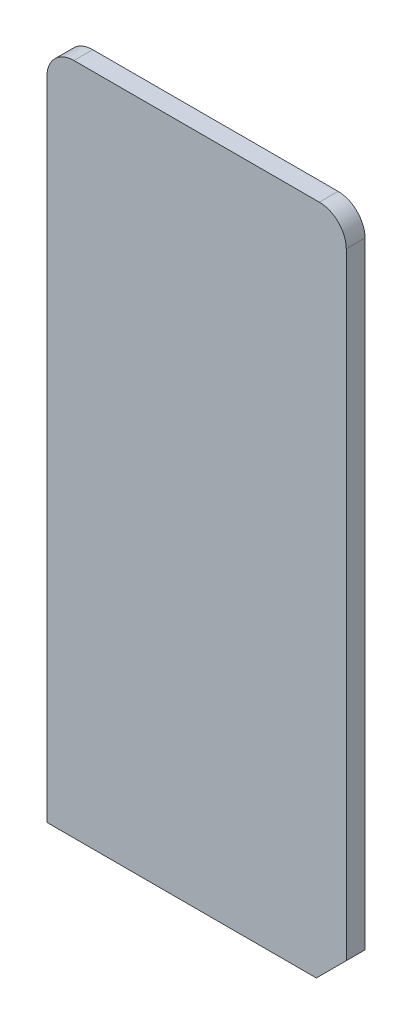
ISO-10303-21;
HEADER;
FILE_DESCRIPTION(('STEP AP214'),'2;1');
FILE_NAME('part.step','',(''),(''),'','','');
FILE_SCHEMA(('AUTOMOTIVE_DESIGN { 1 0 10303 214 1 1 1 1 }'));
ENDSEC;
DATA;
#1=APPLICATION_CONTEXT('core data for automotive mechanical design processes');
#2=APPLICATION_PROTOCOL_DEFINITION('international standard','automotive_design',2000,#1);
#3=PRODUCT_CONTEXT('',#1,'mechanical');
#4=PRODUCT('Part','Part','',(#3));
#5=PRODUCT_RELATED_PRODUCT_CATEGORY('part','',(#4));
#6=PRODUCT_DEFINITION_FORMATION('','',#4);
#7=PRODUCT_DEFINITION_CONTEXT('part definition',#1,'design');
#8=PRODUCT_DEFINITION('design','',#6,#7);
#9=PRODUCT_DEFINITION_SHAPE('','',#8);
#10=(LENGTH_UNIT() NAMED_UNIT(*) SI_UNIT(.MILLI.,.METRE.));
#11=(NAMED_UNIT(*) PLANE_ANGLE_UNIT() SI_UNIT($,.RADIAN.));
#12=(NAMED_UNIT(*) SI_UNIT($,.STERADIAN.) SOLID_ANGLE_UNIT());
#13=UNCERTAINTY_MEASURE_WITH_UNIT(LENGTH_MEASURE(1.E-05),#10,'distance_accuracy_value','');
#14=(GEOMETRIC_REPRESENTATION_CONTEXT(3) GLOBAL_UNCERTAINTY_ASSIGNED_CONTEXT((#13)) GLOBAL_UNIT_ASSIGNED_CONTEXT((#10,
#11,#12)) REPRESENTATION_CONTEXT('',''));
#15=CARTESIAN_POINT('',(0.,0.,0.));
#16=DIRECTION('',(0.,0.,1.));
#17=DIRECTION('',(1.,0.,0.));
#18=AXIS2_PLACEMENT_3D('',#15,#16,#17);
#19=CARTESIAN_POINT('',(-1.269999980927,-3.80999994278,-1.591437));
#20=DIRECTION('',(0.,0.,1.));
#21=DIRECTION('',(1.,0.,0.));
#22=AXIS2_PLACEMENT_3D('',#19,#20,#21);
#23=PLANE('',#22);
#24=CARTESIAN_POINT('',(1.017527650657,51.052472520526,-1.591437));
#25=DIRECTION('',(0.,0.,-1.));
#26=DIRECTION('',(-1.,0.,0.));
#27=AXIS2_PLACEMENT_3D('',#24,#25,#26);
#28=CIRCLE('',#27,2.287528142136);
#29=CARTESIAN_POINT('',(1.016000032425,53.340000152588,-1.591437));
#30=VERTEX_POINT('',#29);
#31=CARTESIAN_POINT('',(-1.26999998092691,51.054000854492,-1.591437));
#32=VERTEX_POINT('',#31);
#33=EDGE_CURVE('E96',#30,#32,#28,.F.);
#34=ORIENTED_EDGE('',*,*,#33,.F.);
#35=DIRECTION('',(1.,0.,0.));
#36=VECTOR('',#35,1.);
#37=CARTESIAN_POINT('',(1.016000032425,53.340000152588,-1.591437));
#38=LINE('',#37,#36);
#39=CARTESIAN_POINT('',(21.843999862671,53.3400001525877,-1.591437));
#40=VERTEX_POINT('',#39);
#41=EDGE_CURVE('E111',#40,#30,#38,.F.);
#42=ORIENTED_EDGE('',*,*,#41,.F.);
#43=CARTESIAN_POINT('',(21.842471324535,51.052472316356,-1.591437));
#44=DIRECTION('',(0.,0.,-1.));
#45=DIRECTION('',(-1.,0.,0.));
#46=AXIS2_PLACEMENT_3D('',#43,#44,#45);
#47=CIRCLE('',#46,2.28752834692);
#48=CARTESIAN_POINT('',(24.1299991607667,51.054000854492,-1.591437));
#49=VERTEX_POINT('',#48);
#50=EDGE_CURVE('E20',#49,#40,#47,.F.);
#51=ORIENTED_EDGE('',*,*,#50,.F.);
#52=DIRECTION('',(0.,1.,0.));
#53=VECTOR('',#52,1.);
#54=CARTESIAN_POINT('',(24.129999160767,51.054000854492,-1.591437));
#55=LINE('',#54,#53);
#56=CARTESIAN_POINT('',(24.129999160767,-1.269999980927,-1.591437));
#57=VERTEX_POINT('',#56);
#58=EDGE_CURVE('E60',#57,#49,#55,.T.);
#59=ORIENTED_EDGE('',*,*,#58,.F.);
#60=DIRECTION('',(0.707106648440535,0.707106913932535,0.));
#61=VECTOR('',#60,1.);
#62=CARTESIAN_POINT('',(24.129999160767,-1.269999980927,-1.591437));
#63=LINE('',#62,#61);
#64=CARTESIAN_POINT('',(21.5900001525881,-3.80999994278009,-1.591437));
#65=VERTEX_POINT('',#64);
#66=EDGE_CURVE('E70',#65,#57,#63,.T.);
#67=ORIENTED_EDGE('',*,*,#66,.F.);
#68=DIRECTION('',(1.,0.,0.));
#69=VECTOR('',#68,1.);
#70=CARTESIAN_POINT('',(21.590000152588,-3.80999994278,-1.591437));
#71=LINE('',#70,#69);
#72=CARTESIAN_POINT('',(-1.269999980927,-3.80999994278,-1.591437));
#73=VERTEX_POINT('',#72);
#74=EDGE_CURVE('E81',#73,#65,#71,.T.);
#75=ORIENTED_EDGE('',*,*,#74,.F.);
#76=DIRECTION('',(0.,1.,0.));
#77=VECTOR('',#76,1.);
#78=CARTESIAN_POINT('',(-1.269999980927,-3.80999994278,-1.591437));
#79=LINE('',#78,#77);
#80=EDGE_CURVE('E85',#32,#73,#79,.F.);
#81=ORIENTED_EDGE('',*,*,#80,.F.);
#82=EDGE_LOOP('',(#34,#42,#51,#59,#67,#75,#81));
#83=FACE_BOUND('',#82,.T.);
#84=ADVANCED_FACE('F17',(#83),#23,.F.);
#85=CARTESIAN_POINT('',(21.590000152588,-3.80999994278,-1.591437));
#86=DIRECTION('',(0.,-1.,0.));
#87=DIRECTION('',(0.,0.,-1.));
#88=AXIS2_PLACEMENT_3D('',#85,#86,#87);
#89=PLANE('',#88);
#90=DIRECTION('',(0.,0.,1.));
#91=VECTOR('',#90,1.);
#92=CARTESIAN_POINT('',(-1.269999980927,-3.80999994278,-1.591437));
#93=LINE('',#92,#91);
#94=CARTESIAN_POINT('',(-1.269999980927,-3.80999994278,0.));
#95=VERTEX_POINT('',#94);
#96=EDGE_CURVE('E91',#73,#95,#93,.T.);
#97=ORIENTED_EDGE('',*,*,#96,.F.);
#98=ORIENTED_EDGE('',*,*,#74,.T.);
#99=DIRECTION('',(0.,0.,1.));
#100=VECTOR('',#99,1.);
#101=CARTESIAN_POINT('',(21.5900001525881,-3.80999994278013,-1.591437));
#102=LINE('',#101,#100);
#103=CARTESIAN_POINT('',(21.590000152588,-3.80999994278005,0.));
#104=VERTEX_POINT('',#103);
#105=EDGE_CURVE('E87',#104,#65,#102,.F.);
#106=ORIENTED_EDGE('',*,*,#105,.F.);
#107=DIRECTION('',(1.,0.,0.));
#108=VECTOR('',#107,1.);
#109=CARTESIAN_POINT('',(-1.269999980927,-3.80999994278,0.));
#110=LINE('',#109,#108);
#111=EDGE_CURVE('E94',#95,#104,#110,.T.);
#112=ORIENTED_EDGE('',*,*,#111,.F.);
#113=EDGE_LOOP('',(#97,#98,#106,#112));
#114=FACE_BOUND('',#113,.T.);
#115=ADVANCED_FACE('F92',(#114),#89,.T.);
#116=CARTESIAN_POINT('',(24.129999160767,-1.269999980927,-1.591437));
#117=DIRECTION('',(0.707106913932535,-0.707106648440535,0.));
#118=DIRECTION('',(0.707106648440535,0.707106913932535,0.));
#119=AXIS2_PLACEMENT_3D('',#116,#117,#118);
#120=PLANE('',#119);
#121=ORIENTED_EDGE('',*,*,#105,.T.);
#122=ORIENTED_EDGE('',*,*,#66,.T.);
#123=DIRECTION('',(0.,0.,-1.));
#124=VECTOR('',#123,1.);
#125=CARTESIAN_POINT('',(24.129999160767,-1.269999980927,-1.591437));
#126=LINE('',#125,#124);
#127=CARTESIAN_POINT('',(24.129999160767,-1.269999980927,0.));
#128=VERTEX_POINT('',#127);
#129=EDGE_CURVE('E117',#128,#57,#126,.T.);
#130=ORIENTED_EDGE('',*,*,#129,.F.);
#131=DIRECTION('',(0.707106648440572,0.707106913932498,0.));
#132=VECTOR('',#131,1.);
#133=CARTESIAN_POINT('',(21.590000152588,-3.80999994278,0.));
#134=LINE('',#133,#132);
#135=EDGE_CURVE('E100',#104,#128,#134,.T.);
#136=ORIENTED_EDGE('',*,*,#135,.F.);
#137=EDGE_LOOP('',(#121,#122,#130,#136));
#138=FACE_BOUND('',#137,.T.);
#139=ADVANCED_FACE('F145',(#138),#120,.T.);
#140=CARTESIAN_POINT('',(24.129999160767,51.054000854492,-1.591437));
#141=DIRECTION('',(1.,0.,0.));
#142=DIRECTION('',(0.,0.,-1.));
#143=AXIS2_PLACEMENT_3D('',#140,#141,#142);
#144=PLANE('',#143);
#145=ORIENTED_EDGE('',*,*,#129,.T.);
#146=ORIENTED_EDGE('',*,*,#58,.T.);
#147=DIRECTION('',(0.,0.,-1.));
#148=VECTOR('',#147,1.);
#149=CARTESIAN_POINT('',(24.1299991607664,51.054000854492,-1.591437));
#150=LINE('',#149,#148);
#151=CARTESIAN_POINT('',(24.1299991607666,51.054000854492,0.));
#152=VERTEX_POINT('',#151);
#153=EDGE_CURVE('E116',#152,#49,#150,.T.);
#154=ORIENTED_EDGE('',*,*,#153,.F.);
#155=DIRECTION('',(0.,1.,0.));
#156=VECTOR('',#155,1.);
#157=CARTESIAN_POINT('',(24.129999160767,-3.80999994278,0.));
#158=LINE('',#157,#156);
#159=EDGE_CURVE('E128',#128,#152,#158,.T.);
#160=ORIENTED_EDGE('',*,*,#159,.F.);
#161=EDGE_LOOP('',(#145,#146,#154,#160));
#162=FACE_BOUND('',#161,.T.);
#163=ADVANCED_FACE('F197',(#162),#144,.T.);
#164=CARTESIAN_POINT('',(21.842471324535,51.052472316356,-1.591437));
#165=DIRECTION('',(0.,0.,-1.));
#166=DIRECTION('',(-1.,0.,0.));
#167=AXIS2_PLACEMENT_3D('',#164,#165,#166);
#168=CYLINDRICAL_SURFACE('',#167,2.28752834692);
#169=ORIENTED_EDGE('',*,*,#153,.T.);
#170=ORIENTED_EDGE('',*,*,#50,.T.);
#171=DIRECTION('',(0.,0.,1.));
#172=VECTOR('',#171,1.);
#173=CARTESIAN_POINT('',(21.843999862671,53.340000152588,-1.591437));
#174=LINE('',#173,#172);
#175=CARTESIAN_POINT('',(21.843999862671,53.340000152588,0.));
#176=VERTEX_POINT('',#175);
#177=EDGE_CURVE('E114',#176,#40,#174,.F.);
#178=ORIENTED_EDGE('',*,*,#177,.F.);
#179=CARTESIAN_POINT('',(21.842471324535,51.052472316356,0.));
#180=DIRECTION('',(0.,0.,-1.));
#181=DIRECTION('',(-1.,0.,0.));
#182=AXIS2_PLACEMENT_3D('',#179,#180,#181);
#183=CIRCLE('',#182,2.28752834692);
#184=EDGE_CURVE('E126',#152,#176,#183,.F.);
#185=ORIENTED_EDGE('',*,*,#184,.F.);
#186=EDGE_LOOP('',(#169,#170,#178,#185));
#187=FACE_BOUND('',#186,.T.);
#188=ADVANCED_FACE('F162',(#187),#168,.T.);
#189=CARTESIAN_POINT('',(1.016000032425,53.340000152588,-1.591437));
#190=DIRECTION('',(0.,1.,0.));
#191=DIRECTION('',(0.,0.,1.));
#192=AXIS2_PLACEMENT_3D('',#189,#190,#191);
#193=PLANE('',#192);
#194=ORIENTED_EDGE('',*,*,#177,.T.);
#195=ORIENTED_EDGE('',*,*,#41,.T.);
#196=DIRECTION('',(0.,0.,-1.));
#197=VECTOR('',#196,1.);
#198=CARTESIAN_POINT('',(1.016000032425,53.3400001525879,-1.591437));
#199=LINE('',#198,#197);
#200=CARTESIAN_POINT('',(1.016000032425,53.3400001525879,0.));
#201=VERTEX_POINT('',#200);
#202=EDGE_CURVE('E113',#201,#30,#199,.T.);
#203=ORIENTED_EDGE('',*,*,#202,.F.);
#204=DIRECTION('',(1.,0.,0.));
#205=VECTOR('',#204,1.);
#206=CARTESIAN_POINT('',(-1.269999980927,53.340000152588,0.));
#207=LINE('',#206,#205);
#208=EDGE_CURVE('E125',#176,#201,#207,.F.);
#209=ORIENTED_EDGE('',*,*,#208,.F.);
#210=EDGE_LOOP('',(#194,#195,#203,#209));
#211=FACE_BOUND('',#210,.T.);
#212=ADVANCED_FACE('F154',(#211),#193,.T.);
#213=CARTESIAN_POINT('',(1.017527650657,51.052472520526,-1.591437));
#214=DIRECTION('',(0.,0.,-1.));
#215=DIRECTION('',(-1.,0.,0.));
#216=AXIS2_PLACEMENT_3D('',#213,#214,#215);
#217=CYLINDRICAL_SURFACE('',#216,2.287528142136);
#218=ORIENTED_EDGE('',*,*,#202,.T.);
#219=ORIENTED_EDGE('',*,*,#33,.T.);
#220=DIRECTION('',(0.,0.,1.));
#221=VECTOR('',#220,1.);
#222=CARTESIAN_POINT('',(-1.269999980927,51.054000854492,-1.591437));
#223=LINE('',#222,#221);
#224=CARTESIAN_POINT('',(-1.269999980927,51.054000854492,0.));
#225=VERTEX_POINT('',#224);
#226=EDGE_CURVE('E35',#225,#32,#223,.F.);
#227=ORIENTED_EDGE('',*,*,#226,.F.);
#228=CARTESIAN_POINT('',(1.017527650657,51.052472520526,0.));
#229=DIRECTION('',(0.,0.,-1.));
#230=DIRECTION('',(-1.,0.,0.));
#231=AXIS2_PLACEMENT_3D('',#228,#229,#230);
#232=CIRCLE('',#231,2.287528142136);
#233=EDGE_CURVE('E26',#201,#225,#232,.F.);
#234=ORIENTED_EDGE('',*,*,#233,.F.);
#235=EDGE_LOOP('',(#218,#219,#227,#234));
#236=FACE_BOUND('',#235,.T.);
#237=ADVANCED_FACE('F152',(#236),#217,.T.);
#238=CARTESIAN_POINT('',(-1.269999980927,-3.80999994278,-1.591437));
#239=DIRECTION('',(-1.,0.,0.));
#240=DIRECTION('',(0.,0.,1.));
#241=AXIS2_PLACEMENT_3D('',#238,#239,#240);
#242=PLANE('',#241);
#243=ORIENTED_EDGE('',*,*,#226,.T.);
#244=ORIENTED_EDGE('',*,*,#80,.T.);
#245=ORIENTED_EDGE('',*,*,#96,.T.);
#246=DIRECTION('',(0.,1.,0.));
#247=VECTOR('',#246,1.);
#248=CARTESIAN_POINT('',(-1.269999980927,-3.80999994278,0.));
#249=LINE('',#248,#247);
#250=EDGE_CURVE('E11',#225,#95,#249,.F.);
#251=ORIENTED_EDGE('',*,*,#250,.F.);
#252=EDGE_LOOP('',(#243,#244,#245,#251));
#253=FACE_BOUND('',#252,.T.);
#254=ADVANCED_FACE('F98',(#253),#242,.T.);
#255=CARTESIAN_POINT('',(-1.269999980927,-3.80999994278,0.));
#256=DIRECTION('',(0.,0.,1.));
#257=DIRECTION('',(1.,0.,0.));
#258=AXIS2_PLACEMENT_3D('',#255,#256,#257);
#259=PLANE('',#258);
#260=ORIENTED_EDGE('',*,*,#233,.T.);
#261=ORIENTED_EDGE('',*,*,#250,.T.);
#262=ORIENTED_EDGE('',*,*,#111,.T.);
#263=ORIENTED_EDGE('',*,*,#135,.T.);
#264=ORIENTED_EDGE('',*,*,#159,.T.);
#265=ORIENTED_EDGE('',*,*,#184,.T.);
#266=ORIENTED_EDGE('',*,*,#208,.T.);
#267=EDGE_LOOP('',(#260,#261,#262,#263,#264,#265,#266));
#268=FACE_BOUND('',#267,.T.);
#269=ADVANCED_FACE('F149',(#268),#259,.T.);
#270=CLOSED_SHELL('',(#84,#115,#139,#163,#188,#212,#237,#254,#269));
#271=MANIFOLD_SOLID_BREP('B1',#270);
#272=ADVANCED_BREP_SHAPE_REPRESENTATION('',(#18,#271),#14);
#273=SHAPE_DEFINITION_REPRESENTATION(#9,#272);
ENDSEC;
END-ISO-10303-21;
